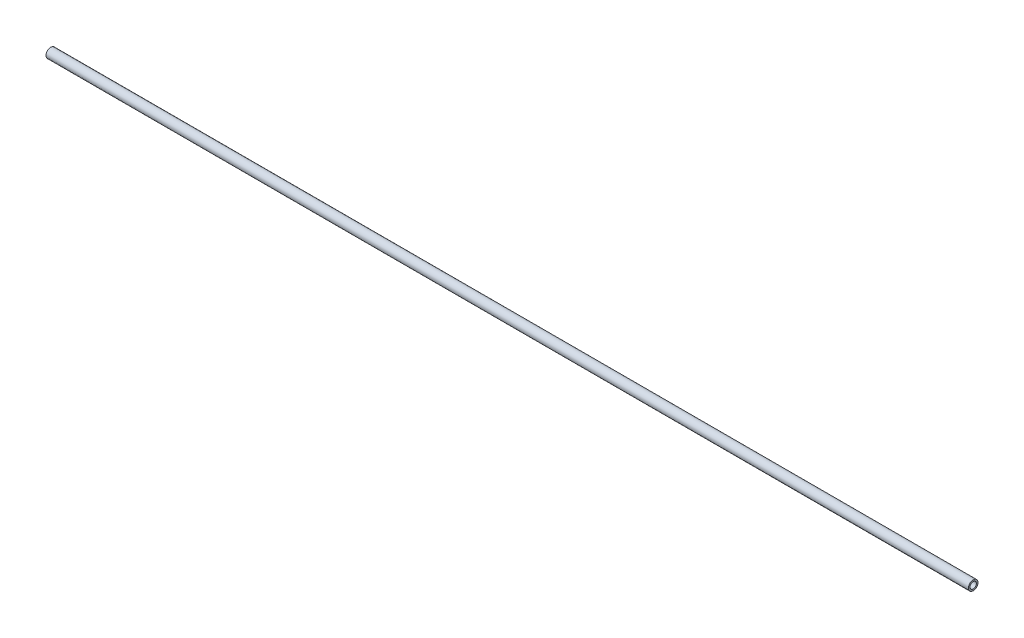
ISO-10303-21;
HEADER;
FILE_DESCRIPTION(('STEP AP214'),'2;1');
FILE_NAME('part.step','',(''),(''),'','','');
FILE_SCHEMA(('AUTOMOTIVE_DESIGN { 1 0 10303 214 1 1 1 1 }'));
ENDSEC;
DATA;
#1=APPLICATION_CONTEXT('core data for automotive mechanical design processes');
#2=APPLICATION_PROTOCOL_DEFINITION('international standard','automotive_design',2000,#1);
#3=PRODUCT_CONTEXT('',#1,'mechanical');
#4=PRODUCT('Part','Part','',(#3));
#5=PRODUCT_RELATED_PRODUCT_CATEGORY('part','',(#4));
#6=PRODUCT_DEFINITION_FORMATION('','',#4);
#7=PRODUCT_DEFINITION_CONTEXT('part definition',#1,'design');
#8=PRODUCT_DEFINITION('design','',#6,#7);
#9=PRODUCT_DEFINITION_SHAPE('','',#8);
#10=(LENGTH_UNIT() NAMED_UNIT(*) SI_UNIT(.MILLI.,.METRE.));
#11=(NAMED_UNIT(*) PLANE_ANGLE_UNIT() SI_UNIT($,.RADIAN.));
#12=(NAMED_UNIT(*) SI_UNIT($,.STERADIAN.) SOLID_ANGLE_UNIT());
#13=UNCERTAINTY_MEASURE_WITH_UNIT(LENGTH_MEASURE(1.E-05),#10,'distance_accuracy_value','');
#14=(GEOMETRIC_REPRESENTATION_CONTEXT(3) GLOBAL_UNCERTAINTY_ASSIGNED_CONTEXT((#13)) GLOBAL_UNIT_ASSIGNED_CONTEXT((#10,
#11,#12)) REPRESENTATION_CONTEXT('',''));
#15=CARTESIAN_POINT('',(0.,0.,0.));
#16=DIRECTION('',(0.,0.,1.));
#17=DIRECTION('',(1.,0.,0.));
#18=AXIS2_PLACEMENT_3D('',#15,#16,#17);
#19=CARTESIAN_POINT('',(-290.,0.,0.));
#20=DIRECTION('',(1.,0.,0.));
#21=DIRECTION('',(0.,0.,-1.));
#22=AXIS2_PLACEMENT_3D('',#19,#20,#21);
#23=CYLINDRICAL_SURFACE('',#22,3.);
#24=CARTESIAN_POINT('',(-290.,0.,0.));
#25=DIRECTION('',(1.,0.,0.));
#26=DIRECTION('',(0.,0.,-1.));
#27=AXIS2_PLACEMENT_3D('',#24,#25,#26);
#28=CIRCLE('',#27,3.);
#29=CARTESIAN_POINT('',(-290.,0.,-3.));
#30=VERTEX_POINT('',#29);
#31=EDGE_CURVE('E10',#30,#30,#28,.T.);
#32=ORIENTED_EDGE('',*,*,#31,.T.);
#33=EDGE_LOOP('',(#32));
#34=FACE_BOUND('',#33,.T.);
#35=CARTESIAN_POINT('',(290.,0.,0.));
#36=DIRECTION('',(1.,0.,0.));
#37=DIRECTION('',(0.,0.,-1.));
#38=AXIS2_PLACEMENT_3D('',#35,#36,#37);
#39=CIRCLE('',#38,3.);
#40=CARTESIAN_POINT('',(290.,0.,-3.));
#41=VERTEX_POINT('',#40);
#42=EDGE_CURVE('E45',#41,#41,#39,.T.);
#43=ORIENTED_EDGE('',*,*,#42,.F.);
#44=EDGE_LOOP('',(#43));
#45=FACE_BOUND('',#44,.T.);
#46=ADVANCED_FACE('F35',(#34,#45),#23,.T.);
#47=CARTESIAN_POINT('',(-290.,0.,0.));
#48=DIRECTION('',(1.,0.,0.));
#49=DIRECTION('',(0.,0.,-1.));
#50=AXIS2_PLACEMENT_3D('',#47,#48,#49);
#51=PLANE('',#50);
#52=CARTESIAN_POINT('',(-290.,0.,0.));
#53=DIRECTION('',(1.,0.,0.));
#54=DIRECTION('',(0.,0.,-1.));
#55=AXIS2_PLACEMENT_3D('',#52,#53,#54);
#56=CIRCLE('',#55,2.);
#57=CARTESIAN_POINT('',(-290.,0.,-2.));
#58=VERTEX_POINT('',#57);
#59=EDGE_CURVE('E41',#58,#58,#56,.T.);
#60=ORIENTED_EDGE('',*,*,#59,.T.);
#61=EDGE_LOOP('',(#60));
#62=FACE_BOUND('',#61,.T.);
#63=ORIENTED_EDGE('',*,*,#31,.F.);
#64=EDGE_LOOP('',(#63));
#65=FACE_BOUND('',#64,.T.);
#66=ADVANCED_FACE('F64',(#62,#65),#51,.F.);
#67=CARTESIAN_POINT('',(-290.,0.,0.));
#68=DIRECTION('',(1.,0.,0.));
#69=DIRECTION('',(0.,0.,-1.));
#70=AXIS2_PLACEMENT_3D('',#67,#68,#69);
#71=CYLINDRICAL_SURFACE('',#70,2.);
#72=ORIENTED_EDGE('',*,*,#59,.F.);
#73=EDGE_LOOP('',(#72));
#74=FACE_BOUND('',#73,.T.);
#75=CARTESIAN_POINT('',(290.,0.,0.));
#76=DIRECTION('',(1.,0.,0.));
#77=DIRECTION('',(0.,0.,-1.));
#78=AXIS2_PLACEMENT_3D('',#75,#76,#77);
#79=CIRCLE('',#78,2.);
#80=CARTESIAN_POINT('',(290.,0.,-2.));
#81=VERTEX_POINT('',#80);
#82=EDGE_CURVE('E49',#81,#81,#79,.T.);
#83=ORIENTED_EDGE('',*,*,#82,.T.);
#84=EDGE_LOOP('',(#83));
#85=FACE_BOUND('',#84,.T.);
#86=ADVANCED_FACE('F55',(#74,#85),#71,.F.);
#87=CARTESIAN_POINT('',(290.,0.,0.));
#88=DIRECTION('',(1.,0.,0.));
#89=DIRECTION('',(0.,0.,-1.));
#90=AXIS2_PLACEMENT_3D('',#87,#88,#89);
#91=PLANE('',#90);
#92=ORIENTED_EDGE('',*,*,#42,.T.);
#93=EDGE_LOOP('',(#92));
#94=FACE_BOUND('',#93,.T.);
#95=ORIENTED_EDGE('',*,*,#82,.F.);
#96=EDGE_LOOP('',(#95));
#97=FACE_BOUND('',#96,.T.);
#98=ADVANCED_FACE('F57',(#94,#97),#91,.T.);
#99=CLOSED_SHELL('',(#46,#66,#86,#98));
#100=MANIFOLD_SOLID_BREP('B2',#99);
#101=ADVANCED_BREP_SHAPE_REPRESENTATION('',(#18,#100),#14);
#102=SHAPE_DEFINITION_REPRESENTATION(#9,#101);
ENDSEC;
END-ISO-10303-21;
